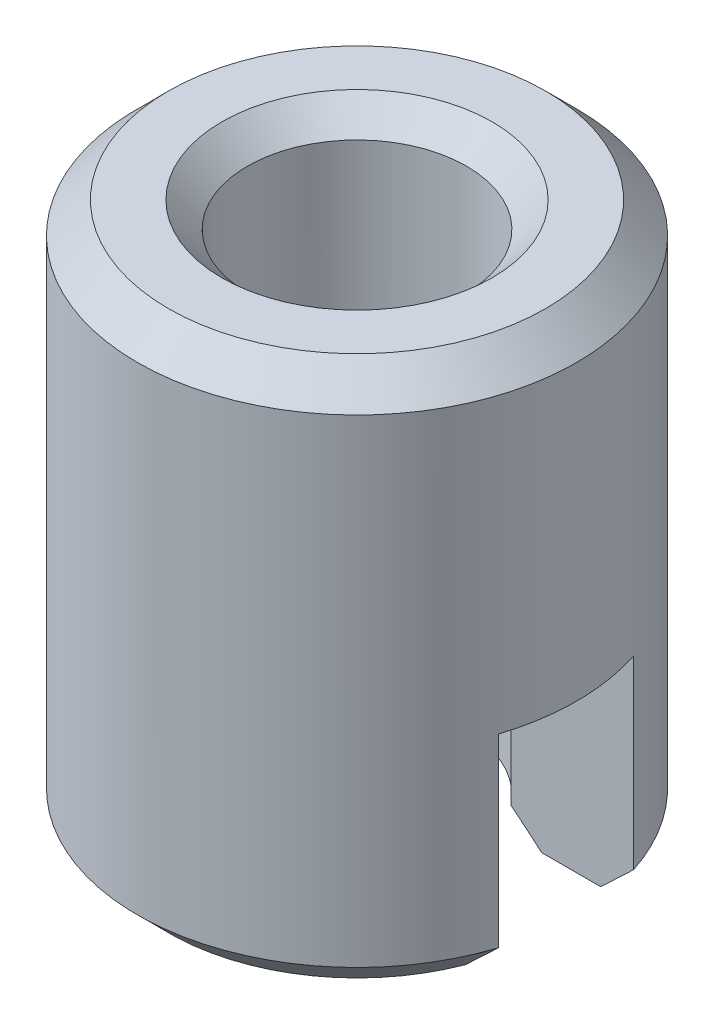
ISO-10303-21;
HEADER;
FILE_DESCRIPTION(('STEP AP214'),'2;1');
FILE_NAME('part.step','',(''),(''),'','','');
FILE_SCHEMA(('AUTOMOTIVE_DESIGN { 1 0 10303 214 1 1 1 1 }'));
ENDSEC;
DATA;
#1=APPLICATION_CONTEXT('core data for automotive mechanical design processes');
#2=APPLICATION_PROTOCOL_DEFINITION('international standard','automotive_design',2000,#1);
#3=PRODUCT_CONTEXT('',#1,'mechanical');
#4=PRODUCT('Part','Part','',(#3));
#5=PRODUCT_RELATED_PRODUCT_CATEGORY('part','',(#4));
#6=PRODUCT_DEFINITION_FORMATION('','',#4);
#7=PRODUCT_DEFINITION_CONTEXT('part definition',#1,'design');
#8=PRODUCT_DEFINITION('design','',#6,#7);
#9=PRODUCT_DEFINITION_SHAPE('','',#8);
#10=(LENGTH_UNIT() NAMED_UNIT(*) SI_UNIT(.MILLI.,.METRE.));
#11=(NAMED_UNIT(*) PLANE_ANGLE_UNIT() SI_UNIT($,.RADIAN.));
#12=(NAMED_UNIT(*) SI_UNIT($,.STERADIAN.) SOLID_ANGLE_UNIT());
#13=UNCERTAINTY_MEASURE_WITH_UNIT(LENGTH_MEASURE(1.E-05),#10,'distance_accuracy_value','');
#14=(GEOMETRIC_REPRESENTATION_CONTEXT(3) GLOBAL_UNCERTAINTY_ASSIGNED_CONTEXT((#13)) GLOBAL_UNIT_ASSIGNED_CONTEXT((#10,
#11,#12)) REPRESENTATION_CONTEXT('',''));
#15=CARTESIAN_POINT('',(0.,0.,0.));
#16=DIRECTION('',(0.,0.,1.));
#17=DIRECTION('',(1.,0.,0.));
#18=AXIS2_PLACEMENT_3D('',#15,#16,#17);
#19=CARTESIAN_POINT('',(0.,5.6843418860808E-11,0.));
#20=DIRECTION('',(0.,-1.,0.));
#21=DIRECTION('',(0.,0.,-1.));
#22=AXIS2_PLACEMENT_3D('',#19,#20,#21);
#23=CONICAL_SURFACE('',#22,1.99999999995271,0.785398163397448);
#24=CARTESIAN_POINT('',(0.,0.379,0.));
#25=DIRECTION('',(0.,-1.,0.));
#26=DIRECTION('',(0.,0.,-1.));
#27=AXIS2_PLACEMENT_3D('',#24,#25,#26);
#28=CIRCLE('',#27,1.621);
#29=CARTESIAN_POINT('',(1.2757903432792,0.379000000003396,-1.));
#30=VERTEX_POINT('',#29);
#31=CARTESIAN_POINT('',(-1.2757903432792,0.379000000003396,-1.));
#32=VERTEX_POINT('',#31);
#33=EDGE_CURVE('E109',#30,#32,#28,.F.);
#34=ORIENTED_EDGE('',*,*,#33,.T.);
#35=CARTESIAN_POINT('',(-1.73205080755299,2.33078933138062E-11,-1.));
#36=CARTESIAN_POINT('',(-1.69467986888539,0.0323602981295743,-1.));
#37=CARTESIAN_POINT('',(-1.65718261707932,0.064575861076217,-1.));
#38=CARTESIAN_POINT('',(-1.58188785818054,0.128643670591893,-1.));
#39=CARTESIAN_POINT('',(-1.54409039203635,0.160495965313725,-1.));
#40=CARTESIAN_POINT('',(-1.46813604362072,0.223773389375999,-1.));
#41=CARTESIAN_POINT('',(-1.42997914688538,0.255198501400731,-1.));
#42=CARTESIAN_POINT('',(-1.35322906659721,0.317521535474524,-1.));
#43=CARTESIAN_POINT('',(-1.31463582501806,0.348419386002765,-1.));
#44=CARTESIAN_POINT('',(-1.27579034328096,0.379000000006793,-1.));
#45=B_SPLINE_CURVE_WITH_KNOTS('',3,(#35,#36,#37,#38,#39,#40,#41,#42,#43,#44),.UNSPECIFIED.,.F.,
.F.,(4,2,2,2,4),(0.,0.148304361652434,0.296588830923304,0.444879293040327,0.593189712760014),.UNSPECIFIED.);
#46=CARTESIAN_POINT('',(-1.73205080753363,4.00757596685903E-11,-1.));
#47=VERTEX_POINT('',#46);
#48=EDGE_CURVE('E20',#47,#32,#45,.T.);
#49=ORIENTED_EDGE('',*,*,#48,.F.);
#50=CARTESIAN_POINT('',(0.,5.6843418860808E-11,0.));
#51=DIRECTION('',(0.,-1.,0.));
#52=DIRECTION('',(0.,0.,-1.));
#53=AXIS2_PLACEMENT_3D('',#50,#51,#52);
#54=CIRCLE('',#53,1.99999999995271);
#55=CARTESIAN_POINT('',(1.73205080753363,4.00757179530736E-11,-1.));
#56=VERTEX_POINT('',#55);
#57=EDGE_CURVE('E106',#56,#47,#54,.F.);
#58=ORIENTED_EDGE('',*,*,#57,.F.);
#59=CARTESIAN_POINT('',(1.27579034328096,0.379000000006793,-1.));
#60=CARTESIAN_POINT('',(1.31463582501805,0.348419386002759,-1.));
#61=CARTESIAN_POINT('',(1.3532290665972,0.317521535474521,-1.));
#62=CARTESIAN_POINT('',(1.42997914688538,0.255198501400737,-1.));
#63=CARTESIAN_POINT('',(1.46813604362072,0.22377338937601,-1.));
#64=CARTESIAN_POINT('',(1.54409039203634,0.160495965313722,-1.));
#65=CARTESIAN_POINT('',(1.58188785818052,0.128643670591872,-1.));
#66=CARTESIAN_POINT('',(1.65718261707933,0.0645758610762496,-1.));
#67=CARTESIAN_POINT('',(1.69467986888546,0.0323602981296779,-1.));
#68=CARTESIAN_POINT('',(1.73205080755321,2.35817071899314E-11,-1.));
#69=B_SPLINE_CURVE_WITH_KNOTS('',3,(#59,#60,#61,#62,#63,#64,#65,#66,#67,#68),.UNSPECIFIED.,.F.,
.F.,(4,2,2,2,4),(0.,0.148310419719683,0.296600881836704,0.444885351107571,0.593189712759998),.UNSPECIFIED.);
#70=EDGE_CURVE('E112',#30,#56,#69,.T.);
#71=ORIENTED_EDGE('',*,*,#70,.F.);
#72=EDGE_LOOP('',(#34,#49,#58,#71));
#73=FACE_BOUND('',#72,.T.);
#74=ADVANCED_FACE('F16',(#73),#23,.F.);
#75=CARTESIAN_POINT('',(0.,5.6843418860808E-11,0.));
#76=DIRECTION('',(0.,-1.,0.));
#77=DIRECTION('',(0.,0.,-1.));
#78=AXIS2_PLACEMENT_3D('',#75,#76,#77);
#79=CONICAL_SURFACE('',#78,1.99999999995271,0.785398163397448);
#80=CARTESIAN_POINT('',(0.,5.6843418860808E-11,0.));
#81=DIRECTION('',(0.,-1.,0.));
#82=DIRECTION('',(0.,0.,-1.));
#83=AXIS2_PLACEMENT_3D('',#80,#81,#82);
#84=CIRCLE('',#83,1.99999999995271);
#85=CARTESIAN_POINT('',(-1.73205080753363,4.00757179530736E-11,1.));
#86=VERTEX_POINT('',#85);
#87=CARTESIAN_POINT('',(1.73205080753363,4.00756636392545E-11,1.));
#88=VERTEX_POINT('',#87);
#89=EDGE_CURVE('E132',#86,#88,#84,.F.);
#90=ORIENTED_EDGE('',*,*,#89,.F.);
#91=CARTESIAN_POINT('',(-1.27579034328095,0.379000000006793,1.));
#92=CARTESIAN_POINT('',(-1.31463582501805,0.348419386002759,1.));
#93=CARTESIAN_POINT('',(-1.3532290665972,0.317521535474521,1.));
#94=CARTESIAN_POINT('',(-1.42997914688538,0.255198501400737,1.));
#95=CARTESIAN_POINT('',(-1.46813604362072,0.22377338937601,1.));
#96=CARTESIAN_POINT('',(-1.54409039203634,0.160495965313722,1.));
#97=CARTESIAN_POINT('',(-1.58188785818051,0.128643670591872,1.));
#98=CARTESIAN_POINT('',(-1.65718261707933,0.0645758610762498,1.));
#99=CARTESIAN_POINT('',(-1.69467986888546,0.032360298129678,1.));
#100=CARTESIAN_POINT('',(-1.73205080755321,2.35816797238127E-11,1.));
#101=B_SPLINE_CURVE_WITH_KNOTS('',3,(#91,#92,#93,#94,#95,#96,#97,#98,#99,#100),.UNSPECIFIED.,
.F.,.F.,(4,2,2,2,4),(0.,0.148310419719683,0.296600881836704,0.444885351107571,
0.593189712759999),.UNSPECIFIED.);
#102=CARTESIAN_POINT('',(-1.2757903432792,0.379000000003396,1.));
#103=VERTEX_POINT('',#102);
#104=EDGE_CURVE('E129',#103,#86,#101,.T.);
#105=ORIENTED_EDGE('',*,*,#104,.F.);
#106=CARTESIAN_POINT('',(0.,0.379,0.));
#107=DIRECTION('',(0.,-1.,0.));
#108=DIRECTION('',(0.,0.,-1.));
#109=AXIS2_PLACEMENT_3D('',#106,#107,#108);
#110=CIRCLE('',#109,1.621);
#111=CARTESIAN_POINT('',(1.2757903432792,0.379000000003396,1.));
#112=VERTEX_POINT('',#111);
#113=EDGE_CURVE('E248',#103,#112,#110,.F.);
#114=ORIENTED_EDGE('',*,*,#113,.T.);
#115=CARTESIAN_POINT('',(1.73205080755299,2.33078747274832E-11,1.));
#116=CARTESIAN_POINT('',(1.69467986888539,0.0323602981295743,1.));
#117=CARTESIAN_POINT('',(1.65718261707932,0.064575861076217,1.));
#118=CARTESIAN_POINT('',(1.58188785818054,0.128643670591893,1.));
#119=CARTESIAN_POINT('',(1.54409039203635,0.160495965313725,1.));
#120=CARTESIAN_POINT('',(1.46813604362072,0.223773389375999,1.));
#121=CARTESIAN_POINT('',(1.42997914688538,0.255198501400731,1.));
#122=CARTESIAN_POINT('',(1.35322906659721,0.317521535474523,1.));
#123=CARTESIAN_POINT('',(1.31463582501806,0.348419386002765,1.));
#124=CARTESIAN_POINT('',(1.27579034328096,0.379000000006793,1.));
#125=B_SPLINE_CURVE_WITH_KNOTS('',3,(#115,#116,#117,#118,#119,#120,#121,#122,#123,#124),
.UNSPECIFIED.,.F.,.F.,(4,2,2,2,4),(0.,0.148304361652434,0.296588830923304,0.444879293040327,
0.593189712760013),.UNSPECIFIED.);
#126=EDGE_CURVE('E126',#88,#112,#125,.T.);
#127=ORIENTED_EDGE('',*,*,#126,.F.);
#128=EDGE_LOOP('',(#90,#105,#114,#127));
#129=FACE_BOUND('',#128,.T.);
#130=ADVANCED_FACE('F147',(#129),#79,.F.);
#131=CARTESIAN_POINT('',(0.,7.99999999992451,0.));
#132=DIRECTION('',(0.,1.,0.));
#133=DIRECTION('',(0.,0.,1.));
#134=AXIS2_PLACEMENT_3D('',#131,#132,#133);
#135=CONICAL_SURFACE('',#134,1.99999999983902,0.785398163397448);
#136=CARTESIAN_POINT('',(0.,7.99999999998136,0.));
#137=DIRECTION('',(0.,1.,0.));
#138=DIRECTION('',(0.,0.,1.));
#139=AXIS2_PLACEMENT_3D('',#136,#137,#138);
#140=CIRCLE('',#139,1.99999999989586);
#141=CARTESIAN_POINT('',(0.,7.99999999998136,1.99999999989586));
#142=VERTEX_POINT('',#141);
#143=EDGE_CURVE('E242',#142,#142,#140,.F.);
#144=ORIENTED_EDGE('',*,*,#143,.F.);
#145=EDGE_LOOP('',(#144));
#146=FACE_BOUND('',#145,.T.);
#147=CARTESIAN_POINT('',(0.,7.621,0.));
#148=DIRECTION('',(0.,-1.,0.));
#149=DIRECTION('',(0.,0.,-1.));
#150=AXIS2_PLACEMENT_3D('',#147,#148,#149);
#151=CIRCLE('',#150,1.621);
#152=CARTESIAN_POINT('',(0.,7.621,-1.621));
#153=VERTEX_POINT('',#152);
#154=EDGE_CURVE('E122',#153,#153,#151,.T.);
#155=ORIENTED_EDGE('',*,*,#154,.T.);
#156=EDGE_LOOP('',(#155));
#157=FACE_BOUND('',#156,.T.);
#158=ADVANCED_FACE('F151',(#146,#157),#135,.F.);
#159=CARTESIAN_POINT('',(0.,0.,0.));
#160=DIRECTION('',(0.,-1.,0.));
#161=DIRECTION('',(0.,0.,-1.));
#162=AXIS2_PLACEMENT_3D('',#159,#160,#161);
#163=PLANE('',#162);
#164=DIRECTION('',(1.,0.,0.));
#165=VECTOR('',#164,1.);
#166=CARTESIAN_POINT('',(0.,0.,-1.));
#167=LINE('',#166,#165);
#168=CARTESIAN_POINT('',(-2.604630492002,2.8421709430404E-11,-1.));
#169=VERTEX_POINT('',#168);
#170=EDGE_CURVE('E114',#47,#169,#167,.F.);
#171=ORIENTED_EDGE('',*,*,#170,.T.);
#172=CARTESIAN_POINT('',(0.,5.6843418860808E-11,0.));
#173=DIRECTION('',(0.,1.,0.));
#174=DIRECTION('',(-1.,0.,0.));
#175=AXIS2_PLACEMENT_3D('',#172,#173,#174);
#176=CIRCLE('',#175,2.79000000000451);
#177=CARTESIAN_POINT('',(2.604630492002,2.84217202917349E-11,-1.));
#178=VERTEX_POINT('',#177);
#179=EDGE_CURVE('E220',#178,#169,#176,.T.);
#180=ORIENTED_EDGE('',*,*,#179,.F.);
#181=DIRECTION('',(-1.,0.,0.));
#182=VECTOR('',#181,1.);
#183=CARTESIAN_POINT('',(0.,0.,-1.));
#184=LINE('',#183,#182);
#185=EDGE_CURVE('E125',#178,#56,#184,.T.);
#186=ORIENTED_EDGE('',*,*,#185,.T.);
#187=ORIENTED_EDGE('',*,*,#57,.T.);
#188=EDGE_LOOP('',(#171,#180,#186,#187));
#189=FACE_BOUND('',#188,.T.);
#190=ADVANCED_FACE('F124',(#189),#163,.T.);
#191=CARTESIAN_POINT('',(0.,4.,0.));
#192=DIRECTION('',(0.,-1.,0.));
#193=DIRECTION('',(0.,0.,-1.));
#194=AXIS2_PLACEMENT_3D('',#191,#192,#193);
#195=CYLINDRICAL_SURFACE('',#194,1.621);
#196=DIRECTION('',(0.,1.,0.));
#197=VECTOR('',#196,1.);
#198=CARTESIAN_POINT('',(1.27579034327745,3.2,1.));
#199=LINE('',#198,#197);
#200=CARTESIAN_POINT('',(1.27579034327745,3.2,1.));
#201=VERTEX_POINT('',#200);
#202=EDGE_CURVE('E245',#201,#112,#199,.F.);
#203=ORIENTED_EDGE('',*,*,#202,.T.);
#204=ORIENTED_EDGE('',*,*,#113,.F.);
#205=DIRECTION('',(0.,1.,0.));
#206=VECTOR('',#205,1.);
#207=CARTESIAN_POINT('',(-1.27579034327745,3.2,1.));
#208=LINE('',#207,#206);
#209=CARTESIAN_POINT('',(-1.27579034327745,3.2,1.));
#210=VERTEX_POINT('',#209);
#211=EDGE_CURVE('E208',#103,#210,#208,.T.);
#212=ORIENTED_EDGE('',*,*,#211,.T.);
#213=CARTESIAN_POINT('',(0.,3.2,0.));
#214=DIRECTION('',(0.,-1.,0.));
#215=DIRECTION('',(0.,0.,-1.));
#216=AXIS2_PLACEMENT_3D('',#213,#214,#215);
#217=CIRCLE('',#216,1.621);
#218=CARTESIAN_POINT('',(-1.27579034327745,3.2,-1.));
#219=VERTEX_POINT('',#218);
#220=EDGE_CURVE('E209',#210,#219,#217,.T.);
#221=ORIENTED_EDGE('',*,*,#220,.T.);
#222=DIRECTION('',(0.,1.,0.));
#223=VECTOR('',#222,1.);
#224=CARTESIAN_POINT('',(-1.27579034327745,0.,-1.));
#225=LINE('',#224,#223);
#226=EDGE_CURVE('E219',#219,#32,#225,.F.);
#227=ORIENTED_EDGE('',*,*,#226,.T.);
#228=ORIENTED_EDGE('',*,*,#33,.F.);
#229=DIRECTION('',(0.,1.,0.));
#230=VECTOR('',#229,1.);
#231=CARTESIAN_POINT('',(1.27579034327745,0.,-1.));
#232=LINE('',#231,#230);
#233=CARTESIAN_POINT('',(1.27579034327745,3.2,-1.));
#234=VERTEX_POINT('',#233);
#235=EDGE_CURVE('E237',#30,#234,#232,.T.);
#236=ORIENTED_EDGE('',*,*,#235,.T.);
#237=CARTESIAN_POINT('',(0.,3.2,0.));
#238=DIRECTION('',(0.,-1.,0.));
#239=DIRECTION('',(0.,0.,-1.));
#240=AXIS2_PLACEMENT_3D('',#237,#238,#239);
#241=CIRCLE('',#240,1.621);
#242=EDGE_CURVE('E238',#234,#201,#241,.T.);
#243=ORIENTED_EDGE('',*,*,#242,.T.);
#244=EDGE_LOOP('',(#203,#204,#212,#221,#227,#228,#236,#243));
#245=FACE_BOUND('',#244,.T.);
#246=ORIENTED_EDGE('',*,*,#154,.F.);
#247=EDGE_LOOP('',(#246));
#248=FACE_BOUND('',#247,.T.);
#249=ADVANCED_FACE('F159',(#245,#248),#195,.F.);
#250=CARTESIAN_POINT('',(0.,0.,0.));
#251=DIRECTION('',(0.,-1.,0.));
#252=DIRECTION('',(0.,0.,-1.));
#253=AXIS2_PLACEMENT_3D('',#250,#251,#252);
#254=PLANE('',#253);
#255=DIRECTION('',(1.,0.,0.));
#256=VECTOR('',#255,1.);
#257=CARTESIAN_POINT('',(0.,0.,1.));
#258=LINE('',#257,#256);
#259=CARTESIAN_POINT('',(-2.604630492002,2.84217202917349E-11,1.));
#260=VERTEX_POINT('',#259);
#261=EDGE_CURVE('E277',#260,#86,#258,.T.);
#262=ORIENTED_EDGE('',*,*,#261,.T.);
#263=ORIENTED_EDGE('',*,*,#89,.T.);
#264=DIRECTION('',(1.,0.,0.));
#265=VECTOR('',#264,1.);
#266=CARTESIAN_POINT('',(0.,0.,1.));
#267=LINE('',#266,#265);
#268=CARTESIAN_POINT('',(2.604630492002,2.8421709430404E-11,1.));
#269=VERTEX_POINT('',#268);
#270=EDGE_CURVE('E243',#88,#269,#267,.T.);
#271=ORIENTED_EDGE('',*,*,#270,.T.);
#272=CARTESIAN_POINT('',(0.,5.6843418860808E-11,0.));
#273=DIRECTION('',(0.,1.,0.));
#274=DIRECTION('',(-1.,0.,0.));
#275=AXIS2_PLACEMENT_3D('',#272,#273,#274);
#276=CIRCLE('',#275,2.79000000000451);
#277=EDGE_CURVE('E270',#260,#269,#276,.T.);
#278=ORIENTED_EDGE('',*,*,#277,.F.);
#279=EDGE_LOOP('',(#262,#263,#271,#278));
#280=FACE_BOUND('',#279,.T.);
#281=ADVANCED_FACE('F162',(#280),#254,.T.);
#282=CARTESIAN_POINT('',(0.,8.,-2.79));
#283=DIRECTION('',(0.,1.,0.));
#284=DIRECTION('',(0.,0.,1.));
#285=AXIS2_PLACEMENT_3D('',#282,#283,#284);
#286=PLANE('',#285);
#287=ORIENTED_EDGE('',*,*,#143,.T.);
#288=EDGE_LOOP('',(#287));
#289=FACE_BOUND('',#288,.T.);
#290=CARTESIAN_POINT('',(0.,7.99999999998136,0.));
#291=DIRECTION('',(0.,-1.,0.));
#292=DIRECTION('',(0.,0.,-1.));
#293=AXIS2_PLACEMENT_3D('',#290,#291,#292);
#294=CIRCLE('',#293,2.79000000006135);
#295=CARTESIAN_POINT('',(0.,7.99999999998136,-2.79000000006135));
#296=VERTEX_POINT('',#295);
#297=EDGE_CURVE('E268',#296,#296,#294,.T.);
#298=ORIENTED_EDGE('',*,*,#297,.F.);
#299=EDGE_LOOP('',(#298));
#300=FACE_BOUND('',#299,.T.);
#301=ADVANCED_FACE('F165',(#289,#300),#286,.T.);
#302=CARTESIAN_POINT('',(0.,3.2,1.));
#303=DIRECTION('',(0.,0.,1.));
#304=DIRECTION('',(1.,0.,0.));
#305=AXIS2_PLACEMENT_3D('',#302,#303,#304);
#306=PLANE('',#305);
#307=DIRECTION('',(1.,0.,0.));
#308=VECTOR('',#307,1.);
#309=CARTESIAN_POINT('',(0.,3.2,1.));
#310=LINE('',#309,#308);
#311=CARTESIAN_POINT('',(3.09232921921325,3.2,1.));
#312=VERTEX_POINT('',#311);
#313=EDGE_CURVE('E241',#201,#312,#310,.T.);
#314=ORIENTED_EDGE('',*,*,#313,.T.);
#315=DIRECTION('',(0.,-1.,0.));
#316=VECTOR('',#315,1.);
#317=CARTESIAN_POINT('',(3.09232921921325,4.,0.999999999999999));
#318=LINE('',#317,#316);
#319=CARTESIAN_POINT('',(3.09232921920881,0.459999999993527,1.));
#320=VERTEX_POINT('',#319);
#321=EDGE_CURVE('E267',#320,#312,#318,.F.);
#322=ORIENTED_EDGE('',*,*,#321,.F.);
#323=CARTESIAN_POINT('',(2.60463049200853,3.45167334807821E-11,1.));
#324=CARTESIAN_POINT('',(2.64546808605378,0.038125054922553,1.));
#325=CARTESIAN_POINT('',(2.6862489297274,0.0763108212882045,1.));
#326=CARTESIAN_POINT('',(2.76770886841199,0.152790285134948,1.));
#327=CARTESIAN_POINT('',(2.80838796398908,0.19108398201299,1.));
#328=CARTESIAN_POINT('',(2.88965656567964,0.267766195186852,1.));
#329=CARTESIAN_POINT('',(2.93024607189903,0.306154711370461,1.));
#330=CARTESIAN_POINT('',(3.01134522908715,0.383016460970061,1.));
#331=CARTESIAN_POINT('',(3.05185487960974,0.421489694856828,1.));
#332=CARTESIAN_POINT('',(3.09232921920438,0.459999999987054,1.));
#333=B_SPLINE_CURVE_WITH_KNOTS('',3,(#323,#324,#325,#326,#327,#328,#329,#330,#331,#332),
.UNSPECIFIED.,.F.,.F.,(4,2,2,2,4),(0.,0.167603741481662,0.335206548345603,0.502809156961316,
0.67041269930342),.UNSPECIFIED.);
#334=EDGE_CURVE('E203',#269,#320,#333,.T.);
#335=ORIENTED_EDGE('',*,*,#334,.F.);
#336=ORIENTED_EDGE('',*,*,#270,.F.);
#337=ORIENTED_EDGE('',*,*,#126,.T.);
#338=ORIENTED_EDGE('',*,*,#202,.F.);
#339=EDGE_LOOP('',(#314,#322,#335,#336,#337,#338));
#340=FACE_BOUND('',#339,.T.);
#341=ADVANCED_FACE('F143',(#340),#306,.F.);
#342=CARTESIAN_POINT('',(0.,3.2,-1.));
#343=DIRECTION('',(0.,1.,0.));
#344=DIRECTION('',(0.,0.,1.));
#345=AXIS2_PLACEMENT_3D('',#342,#343,#344);
#346=PLANE('',#345);
#347=DIRECTION('',(-1.,0.,0.));
#348=VECTOR('',#347,1.);
#349=CARTESIAN_POINT('',(0.,3.2,-1.));
#350=LINE('',#349,#348);
#351=CARTESIAN_POINT('',(3.09232921921325,3.2,-0.999999999999999));
#352=VERTEX_POINT('',#351);
#353=EDGE_CURVE('E240',#234,#352,#350,.F.);
#354=ORIENTED_EDGE('',*,*,#353,.T.);
#355=CARTESIAN_POINT('',(0.,3.2,0.));
#356=DIRECTION('',(0.,-1.,0.));
#357=DIRECTION('',(0.,0.,-1.));
#358=AXIS2_PLACEMENT_3D('',#355,#356,#357);
#359=CIRCLE('',#358,3.25);
#360=EDGE_CURVE('E263',#312,#352,#359,.F.);
#361=ORIENTED_EDGE('',*,*,#360,.F.);
#362=ORIENTED_EDGE('',*,*,#313,.F.);
#363=ORIENTED_EDGE('',*,*,#242,.F.);
#364=EDGE_LOOP('',(#354,#361,#362,#363));
#365=FACE_BOUND('',#364,.T.);
#366=ADVANCED_FACE('F173',(#365),#346,.F.);
#367=CARTESIAN_POINT('',(0.,0.,-1.));
#368=DIRECTION('',(0.,0.,-1.));
#369=DIRECTION('',(-1.,0.,0.));
#370=AXIS2_PLACEMENT_3D('',#367,#368,#369);
#371=PLANE('',#370);
#372=ORIENTED_EDGE('',*,*,#70,.T.);
#373=ORIENTED_EDGE('',*,*,#185,.F.);
#374=CARTESIAN_POINT('',(3.09232921920438,0.459999999987054,-1.));
#375=CARTESIAN_POINT('',(3.05185487960974,0.421489694856828,-1.));
#376=CARTESIAN_POINT('',(3.01134522908715,0.383016460970062,-1.));
#377=CARTESIAN_POINT('',(2.93024607189903,0.306154711370461,-1.));
#378=CARTESIAN_POINT('',(2.88965656567964,0.267766195186852,-1.));
#379=CARTESIAN_POINT('',(2.80838796398908,0.19108398201299,-1.));
#380=CARTESIAN_POINT('',(2.76770886841199,0.152790285134948,-1.));
#381=CARTESIAN_POINT('',(2.6862489297274,0.0763108212882046,-1.));
#382=CARTESIAN_POINT('',(2.64546808605378,0.0381250549225531,-1.));
#383=CARTESIAN_POINT('',(2.60463049200853,3.45165843548434E-11,-1.));
#384=B_SPLINE_CURVE_WITH_KNOTS('',3,(#374,#375,#376,#377,#378,#379,#380,#381,#382,#383),
.UNSPECIFIED.,.F.,.F.,(4,2,2,2,4),(0.,0.167603542342104,0.335206150957817,0.502808957821758,
0.67041269930342),.UNSPECIFIED.);
#385=CARTESIAN_POINT('',(3.09232921920881,0.459999999993527,-0.999999999999999));
#386=VERTEX_POINT('',#385);
#387=EDGE_CURVE('E231',#386,#178,#384,.T.);
#388=ORIENTED_EDGE('',*,*,#387,.F.);
#389=DIRECTION('',(0.,-1.,0.));
#390=VECTOR('',#389,1.);
#391=CARTESIAN_POINT('',(3.09232921921325,4.,-0.999999999999999));
#392=LINE('',#391,#390);
#393=EDGE_CURVE('E266',#352,#386,#392,.T.);
#394=ORIENTED_EDGE('',*,*,#393,.F.);
#395=ORIENTED_EDGE('',*,*,#353,.F.);
#396=ORIENTED_EDGE('',*,*,#235,.F.);
#397=EDGE_LOOP('',(#372,#373,#388,#394,#395,#396));
#398=FACE_BOUND('',#397,.T.);
#399=ADVANCED_FACE('F227',(#398),#371,.F.);
#400=CARTESIAN_POINT('',(0.,0.459999999918637,0.));
#401=DIRECTION('',(0.,1.,0.));
#402=DIRECTION('',(-1.,0.,0.));
#403=AXIS2_PLACEMENT_3D('',#400,#401,#402);
#404=CONICAL_SURFACE('',#403,3.24999999992315,0.785398163459235);
#405=CARTESIAN_POINT('',(-2.60463049200763,3.36755444464106E-11,-1.));
#406=CARTESIAN_POINT('',(-2.64546808605389,0.0381250549226537,-1.));
#407=CARTESIAN_POINT('',(-2.68624892972851,0.0763108212892502,-1.));
#408=CARTESIAN_POINT('',(-2.76770886841511,0.152790285137889,-1.));
#409=CARTESIAN_POINT('',(-2.80838796399321,0.191083982016881,-1.));
#410=CARTESIAN_POINT('',(-2.88965656568578,0.267766195192647,-1.));
#411=CARTESIAN_POINT('',(-2.93024607190616,0.306154711377211,-1.));
#412=CARTESIAN_POINT('',(-3.01134522909628,0.383016460978724,-1.));
#413=CARTESIAN_POINT('',(-3.05185487961986,0.421489694866448,-1.));
#414=CARTESIAN_POINT('',(-3.0923292192155,0.459999999997632,-1.));
#415=B_SPLINE_CURVE_WITH_KNOTS('',3,(#405,#406,#407,#408,#409,#410,#411,#412,#413,#414),
.UNSPECIFIED.,.F.,.F.,(4,2,2,2,4),(0.,0.167603741485807,0.335206548353892,0.50280915697375,
0.67041269932),.UNSPECIFIED.);
#416=CARTESIAN_POINT('',(-3.09232921921437,0.459999999998816,-0.999999999999999));
#417=VERTEX_POINT('',#416);
#418=EDGE_CURVE('E118',#169,#417,#415,.T.);
#419=ORIENTED_EDGE('',*,*,#418,.T.);
#420=CARTESIAN_POINT('',(0.,0.46,0.));
#421=DIRECTION('',(0.,-1.,0.));
#422=DIRECTION('',(0.,0.,-1.));
#423=AXIS2_PLACEMENT_3D('',#420,#421,#422);
#424=CIRCLE('',#423,3.25);
#425=EDGE_CURVE('E290',#386,#417,#424,.F.);
#426=ORIENTED_EDGE('',*,*,#425,.F.);
#427=ORIENTED_EDGE('',*,*,#387,.T.);
#428=ORIENTED_EDGE('',*,*,#179,.T.);
#429=EDGE_LOOP('',(#419,#426,#427,#428));
#430=FACE_BOUND('',#429,.T.);
#431=ADVANCED_FACE('F223',(#430),#404,.T.);
#432=CARTESIAN_POINT('',(0.,0.,-1.));
#433=DIRECTION('',(0.,0.,-1.));
#434=DIRECTION('',(-1.,0.,0.));
#435=AXIS2_PLACEMENT_3D('',#432,#433,#434);
#436=PLANE('',#435);
#437=DIRECTION('',(1.,0.,0.));
#438=VECTOR('',#437,1.);
#439=CARTESIAN_POINT('',(0.,3.2,-1.));
#440=LINE('',#439,#438);
#441=CARTESIAN_POINT('',(-3.09232921921325,3.2,-0.999999999999999));
#442=VERTEX_POINT('',#441);
#443=EDGE_CURVE('E213',#219,#442,#440,.F.);
#444=ORIENTED_EDGE('',*,*,#443,.T.);
#445=DIRECTION('',(0.,-1.,0.));
#446=VECTOR('',#445,1.);
#447=CARTESIAN_POINT('',(-3.09232921921325,4.,-0.999999999999999));
#448=LINE('',#447,#446);
#449=EDGE_CURVE('E262',#417,#442,#448,.F.);
#450=ORIENTED_EDGE('',*,*,#449,.F.);
#451=ORIENTED_EDGE('',*,*,#418,.F.);
#452=ORIENTED_EDGE('',*,*,#170,.F.);
#453=ORIENTED_EDGE('',*,*,#48,.T.);
#454=ORIENTED_EDGE('',*,*,#226,.F.);
#455=EDGE_LOOP('',(#444,#450,#451,#452,#453,#454));
#456=FACE_BOUND('',#455,.T.);
#457=ADVANCED_FACE('F116',(#456),#436,.F.);
#458=CARTESIAN_POINT('',(0.,3.2,-1.));
#459=DIRECTION('',(0.,1.,0.));
#460=DIRECTION('',(0.,0.,1.));
#461=AXIS2_PLACEMENT_3D('',#458,#459,#460);
#462=PLANE('',#461);
#463=DIRECTION('',(1.,0.,0.));
#464=VECTOR('',#463,1.);
#465=CARTESIAN_POINT('',(0.,3.2,1.));
#466=LINE('',#465,#464);
#467=CARTESIAN_POINT('',(-3.09232921921325,3.2,1.));
#468=VERTEX_POINT('',#467);
#469=EDGE_CURVE('E212',#210,#468,#466,.F.);
#470=ORIENTED_EDGE('',*,*,#469,.T.);
#471=CARTESIAN_POINT('',(0.,3.2,0.));
#472=DIRECTION('',(0.,-1.,0.));
#473=DIRECTION('',(0.,0.,-1.));
#474=AXIS2_PLACEMENT_3D('',#471,#472,#473);
#475=CIRCLE('',#474,3.25);
#476=EDGE_CURVE('E259',#442,#468,#475,.F.);
#477=ORIENTED_EDGE('',*,*,#476,.F.);
#478=ORIENTED_EDGE('',*,*,#443,.F.);
#479=ORIENTED_EDGE('',*,*,#220,.F.);
#480=EDGE_LOOP('',(#470,#477,#478,#479));
#481=FACE_BOUND('',#480,.T.);
#482=ADVANCED_FACE('F313',(#481),#462,.F.);
#483=CARTESIAN_POINT('',(0.,3.2,1.));
#484=DIRECTION('',(0.,0.,1.));
#485=DIRECTION('',(1.,0.,0.));
#486=AXIS2_PLACEMENT_3D('',#483,#484,#485);
#487=PLANE('',#486);
#488=ORIENTED_EDGE('',*,*,#104,.T.);
#489=ORIENTED_EDGE('',*,*,#261,.F.);
#490=CARTESIAN_POINT('',(-3.09232921920438,0.459999999987053,1.));
#491=CARTESIAN_POINT('',(-3.05185487960974,0.421489694856828,1.));
#492=CARTESIAN_POINT('',(-3.01134522908715,0.383016460970061,1.));
#493=CARTESIAN_POINT('',(-2.93024607189903,0.30615471137046,1.));
#494=CARTESIAN_POINT('',(-2.88965656567964,0.267766195186852,1.));
#495=CARTESIAN_POINT('',(-2.80838796398908,0.19108398201299,1.));
#496=CARTESIAN_POINT('',(-2.76770886841198,0.152790285134948,1.));
#497=CARTESIAN_POINT('',(-2.6862489297274,0.0763108212882045,1.));
#498=CARTESIAN_POINT('',(-2.64546808605378,0.038125054922553,1.));
#499=CARTESIAN_POINT('',(-2.60463049200853,3.45165567692036E-11,1.));
#500=B_SPLINE_CURVE_WITH_KNOTS('',3,(#490,#491,#492,#493,#494,#495,#496,#497,#498,#499),
.UNSPECIFIED.,.F.,.F.,(4,2,2,2,4),(0.,0.167603542342104,0.335206150957818,0.502808957821758,
0.67041269930342),.UNSPECIFIED.);
#501=CARTESIAN_POINT('',(-3.09232921920881,0.459999999993527,1.));
#502=VERTEX_POINT('',#501);
#503=EDGE_CURVE('E197',#502,#260,#500,.T.);
#504=ORIENTED_EDGE('',*,*,#503,.F.);
#505=DIRECTION('',(0.,-1.,0.));
#506=VECTOR('',#505,1.);
#507=CARTESIAN_POINT('',(-3.09232921921325,4.,1.));
#508=LINE('',#507,#506);
#509=EDGE_CURVE('E30',#468,#502,#508,.T.);
#510=ORIENTED_EDGE('',*,*,#509,.F.);
#511=ORIENTED_EDGE('',*,*,#469,.F.);
#512=ORIENTED_EDGE('',*,*,#211,.F.);
#513=EDGE_LOOP('',(#488,#489,#504,#510,#511,#512));
#514=FACE_BOUND('',#513,.T.);
#515=ADVANCED_FACE('F192',(#514),#487,.F.);
#516=CARTESIAN_POINT('',(0.,0.459999999918637,0.));
#517=DIRECTION('',(0.,1.,0.));
#518=DIRECTION('',(-1.,0.,0.));
#519=AXIS2_PLACEMENT_3D('',#516,#517,#518);
#520=CONICAL_SURFACE('',#519,3.24999999992315,0.785398163459235);
#521=ORIENTED_EDGE('',*,*,#503,.T.);
#522=ORIENTED_EDGE('',*,*,#277,.T.);
#523=ORIENTED_EDGE('',*,*,#334,.T.);
#524=CARTESIAN_POINT('',(0.,0.46,0.));
#525=DIRECTION('',(0.,-1.,0.));
#526=DIRECTION('',(0.,0.,-1.));
#527=AXIS2_PLACEMENT_3D('',#524,#525,#526);
#528=CIRCLE('',#527,3.25);
#529=EDGE_CURVE('E39',#502,#320,#528,.F.);
#530=ORIENTED_EDGE('',*,*,#529,.F.);
#531=EDGE_LOOP('',(#521,#522,#523,#530));
#532=FACE_BOUND('',#531,.T.);
#533=ADVANCED_FACE('F185',(#532),#520,.T.);
#534=CARTESIAN_POINT('',(0.,7.54000000006272,0.));
#535=DIRECTION('',(0.,-1.,0.));
#536=DIRECTION('',(0.,0.,-1.));
#537=AXIS2_PLACEMENT_3D('',#534,#535,#536);
#538=CONICAL_SURFACE('',#537,3.24999999997999,0.785398163397448);
#539=ORIENTED_EDGE('',*,*,#297,.T.);
#540=EDGE_LOOP('',(#539));
#541=FACE_BOUND('',#540,.T.);
#542=CARTESIAN_POINT('',(0.,7.54,0.));
#543=DIRECTION('',(0.,-1.,0.));
#544=DIRECTION('',(0.,0.,-1.));
#545=AXIS2_PLACEMENT_3D('',#542,#543,#544);
#546=CIRCLE('',#545,3.25);
#547=CARTESIAN_POINT('',(0.,7.54,-3.25));
#548=VERTEX_POINT('',#547);
#549=EDGE_CURVE('E10',#548,#548,#546,.T.);
#550=ORIENTED_EDGE('',*,*,#549,.F.);
#551=EDGE_LOOP('',(#550));
#552=FACE_BOUND('',#551,.T.);
#553=ADVANCED_FACE('F179',(#541,#552),#538,.T.);
#554=CARTESIAN_POINT('',(0.,4.,0.));
#555=DIRECTION('',(0.,-1.,0.));
#556=DIRECTION('',(0.,0.,-1.));
#557=AXIS2_PLACEMENT_3D('',#554,#555,#556);
#558=CYLINDRICAL_SURFACE('',#557,3.25);
#559=ORIENTED_EDGE('',*,*,#549,.T.);
#560=EDGE_LOOP('',(#559));
#561=FACE_BOUND('',#560,.T.);
#562=ORIENTED_EDGE('',*,*,#509,.T.);
#563=ORIENTED_EDGE('',*,*,#529,.T.);
#564=ORIENTED_EDGE('',*,*,#321,.T.);
#565=ORIENTED_EDGE('',*,*,#360,.T.);
#566=ORIENTED_EDGE('',*,*,#393,.T.);
#567=ORIENTED_EDGE('',*,*,#425,.T.);
#568=ORIENTED_EDGE('',*,*,#449,.T.);
#569=ORIENTED_EDGE('',*,*,#476,.T.);
#570=EDGE_LOOP('',(#562,#563,#564,#565,#566,#567,#568,#569));
#571=FACE_BOUND('',#570,.T.);
#572=ADVANCED_FACE('F177',(#561,#571),#558,.T.);
#573=CLOSED_SHELL('',(#74,#130,#158,#190,#249,#281,#301,#341,#366,#399,#431,#457,#482,#515,#533,
#553,#572));
#574=MANIFOLD_SOLID_BREP('B1',#573);
#575=ADVANCED_BREP_SHAPE_REPRESENTATION('',(#18,#574),#14);
#576=SHAPE_DEFINITION_REPRESENTATION(#9,#575);
ENDSEC;
END-ISO-10303-21;
